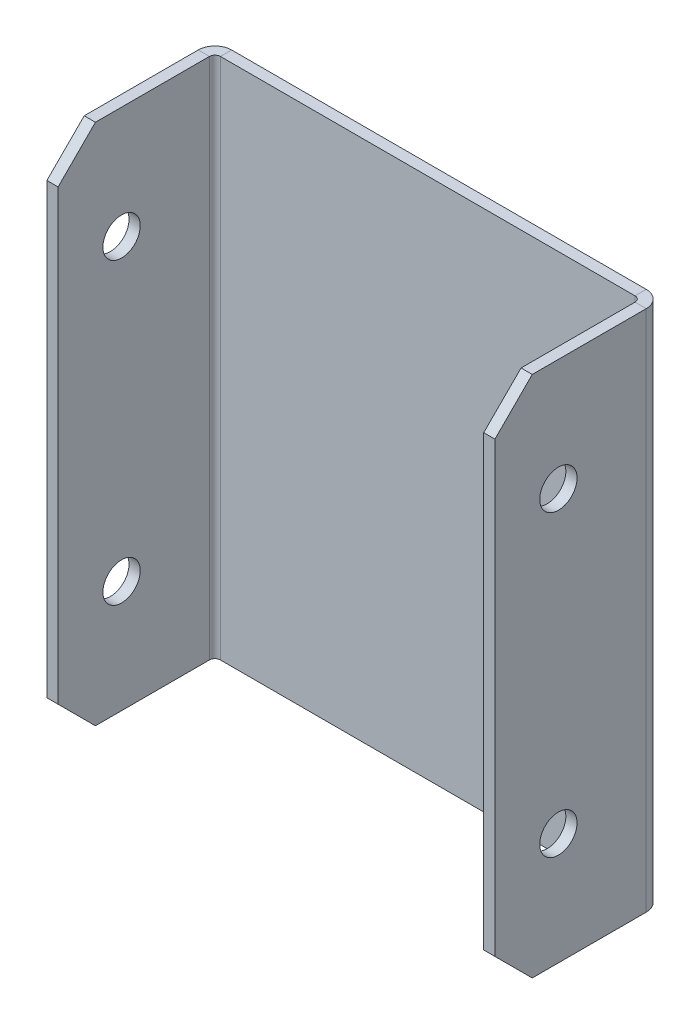
ISO-10303-21;
HEADER;
FILE_DESCRIPTION(('STEP AP214'),'2;1');
FILE_NAME('part.step','',(''),(''),'','','');
FILE_SCHEMA(('AUTOMOTIVE_DESIGN { 1 0 10303 214 1 1 1 1 }'));
ENDSEC;
DATA;
#1=APPLICATION_CONTEXT('core data for automotive mechanical design processes');
#2=APPLICATION_PROTOCOL_DEFINITION('international standard','automotive_design',2000,#1);
#3=PRODUCT_CONTEXT('',#1,'mechanical');
#4=PRODUCT('Part','Part','',(#3));
#5=PRODUCT_RELATED_PRODUCT_CATEGORY('part','',(#4));
#6=PRODUCT_DEFINITION_FORMATION('','',#4);
#7=PRODUCT_DEFINITION_CONTEXT('part definition',#1,'design');
#8=PRODUCT_DEFINITION('design','',#6,#7);
#9=PRODUCT_DEFINITION_SHAPE('','',#8);
#10=(LENGTH_UNIT() NAMED_UNIT(*) SI_UNIT(.MILLI.,.METRE.));
#11=(NAMED_UNIT(*) PLANE_ANGLE_UNIT() SI_UNIT($,.RADIAN.));
#12=(NAMED_UNIT(*) SI_UNIT($,.STERADIAN.) SOLID_ANGLE_UNIT());
#13=UNCERTAINTY_MEASURE_WITH_UNIT(LENGTH_MEASURE(1.E-05),#10,'distance_accuracy_value','');
#14=(GEOMETRIC_REPRESENTATION_CONTEXT(3) GLOBAL_UNCERTAINTY_ASSIGNED_CONTEXT((#13)) GLOBAL_UNIT_ASSIGNED_CONTEXT((#10,
#11,#12)) REPRESENTATION_CONTEXT('',''));
#15=CARTESIAN_POINT('',(0.,0.,0.));
#16=DIRECTION('',(0.,0.,1.));
#17=DIRECTION('',(1.,0.,0.));
#18=AXIS2_PLACEMENT_3D('',#15,#16,#17);
#19=CARTESIAN_POINT('',(0.,0.,-1.5));
#20=DIRECTION('',(0.,0.,1.));
#21=DIRECTION('',(1.,0.,0.));
#22=AXIS2_PLACEMENT_3D('',#19,#20,#21);
#23=PLANE('',#22);
#24=DIRECTION('',(0.,-1.,0.));
#25=VECTOR('',#24,1.);
#26=CARTESIAN_POINT('',(-27.7634,-35.,-1.5));
#27=LINE('',#26,#25);
#28=CARTESIAN_POINT('',(-27.7634,-35.,-1.5));
#29=VERTEX_POINT('',#28);
#30=CARTESIAN_POINT('',(-27.7634,35.,-1.5));
#31=VERTEX_POINT('',#30);
#32=EDGE_CURVE('E205',#29,#31,#27,.F.);
#33=ORIENTED_EDGE('',*,*,#32,.T.);
#34=DIRECTION('',(-1.,0.,0.));
#35=VECTOR('',#34,1.);
#36=CARTESIAN_POINT('',(-30.,35.,-1.5));
#37=LINE('',#36,#35);
#38=CARTESIAN_POINT('',(27.7634,35.,-1.5));
#39=VERTEX_POINT('',#38);
#40=EDGE_CURVE('E316',#39,#31,#37,.T.);
#41=ORIENTED_EDGE('',*,*,#40,.F.);
#42=DIRECTION('',(0.,1.,0.));
#43=VECTOR('',#42,1.);
#44=CARTESIAN_POINT('',(27.7634,35.,-1.5));
#45=LINE('',#44,#43);
#46=CARTESIAN_POINT('',(27.7634,-35.,-1.5));
#47=VERTEX_POINT('',#46);
#48=EDGE_CURVE('E292',#39,#47,#45,.F.);
#49=ORIENTED_EDGE('',*,*,#48,.T.);
#50=DIRECTION('',(1.,0.,0.));
#51=VECTOR('',#50,1.);
#52=CARTESIAN_POINT('',(-30.,-35.,-1.5));
#53=LINE('',#52,#51);
#54=EDGE_CURVE('E319',#29,#47,#53,.T.);
#55=ORIENTED_EDGE('',*,*,#54,.F.);
#56=EDGE_LOOP('',(#33,#41,#49,#55));
#57=FACE_BOUND('',#56,.T.);
#58=ADVANCED_FACE('F81',(#57),#23,.F.);
#59=CARTESIAN_POINT('',(0.,0.,0.));
#60=DIRECTION('',(0.,0.,1.));
#61=DIRECTION('',(1.,0.,0.));
#62=AXIS2_PLACEMENT_3D('',#59,#60,#61);
#63=PLANE('',#62);
#64=DIRECTION('',(-1.,0.,0.));
#65=VECTOR('',#64,1.);
#66=CARTESIAN_POINT('',(-30.,35.,0.));
#67=LINE('',#66,#65);
#68=CARTESIAN_POINT('',(27.7634,35.,0.));
#69=VERTEX_POINT('',#68);
#70=CARTESIAN_POINT('',(-27.7634,35.,0.));
#71=VERTEX_POINT('',#70);
#72=EDGE_CURVE('E313',#69,#71,#67,.T.);
#73=ORIENTED_EDGE('',*,*,#72,.T.);
#74=DIRECTION('',(0.,-1.,0.));
#75=VECTOR('',#74,1.);
#76=CARTESIAN_POINT('',(-27.7634,-35.,0.));
#77=LINE('',#76,#75);
#78=CARTESIAN_POINT('',(-27.7634,-35.,0.));
#79=VERTEX_POINT('',#78);
#80=EDGE_CURVE('E255',#79,#71,#77,.F.);
#81=ORIENTED_EDGE('',*,*,#80,.F.);
#82=DIRECTION('',(1.,0.,0.));
#83=VECTOR('',#82,1.);
#84=CARTESIAN_POINT('',(-30.,-35.,0.));
#85=LINE('',#84,#83);
#86=CARTESIAN_POINT('',(27.7634,-35.,0.));
#87=VERTEX_POINT('',#86);
#88=EDGE_CURVE('E320',#79,#87,#85,.T.);
#89=ORIENTED_EDGE('',*,*,#88,.T.);
#90=DIRECTION('',(0.,1.,0.));
#91=VECTOR('',#90,1.);
#92=CARTESIAN_POINT('',(27.7634,35.,0.));
#93=LINE('',#92,#91);
#94=EDGE_CURVE('E305',#69,#87,#93,.F.);
#95=ORIENTED_EDGE('',*,*,#94,.F.);
#96=EDGE_LOOP('',(#73,#81,#89,#95));
#97=FACE_BOUND('',#96,.T.);
#98=ADVANCED_FACE('F403',(#97),#63,.T.);
#99=CARTESIAN_POINT('',(-30.,-35.,-1.5));
#100=DIRECTION('',(0.,-1.,0.));
#101=DIRECTION('',(0.,0.,-1.));
#102=AXIS2_PLACEMENT_3D('',#99,#100,#101);
#103=PLANE('',#102);
#104=ORIENTED_EDGE('',*,*,#88,.F.);
#105=DIRECTION('',(0.,0.,-1.));
#106=VECTOR('',#105,1.);
#107=CARTESIAN_POINT('',(-27.7634,-35.,0.));
#108=LINE('',#107,#106);
#109=EDGE_CURVE('E251',#79,#29,#108,.T.);
#110=ORIENTED_EDGE('',*,*,#109,.T.);
#111=ORIENTED_EDGE('',*,*,#54,.T.);
#112=DIRECTION('',(0.,0.,-1.));
#113=VECTOR('',#112,1.);
#114=CARTESIAN_POINT('',(27.7634,-35.,0.));
#115=LINE('',#114,#113);
#116=EDGE_CURVE('E310',#87,#47,#115,.T.);
#117=ORIENTED_EDGE('',*,*,#116,.F.);
#118=EDGE_LOOP('',(#104,#110,#111,#117));
#119=FACE_BOUND('',#118,.T.);
#120=ADVANCED_FACE('F407',(#119),#103,.T.);
#121=CARTESIAN_POINT('',(-30.,35.,-1.5));
#122=DIRECTION('',(0.,1.,0.));
#123=DIRECTION('',(0.,0.,1.));
#124=AXIS2_PLACEMENT_3D('',#121,#122,#123);
#125=PLANE('',#124);
#126=DIRECTION('',(0.,0.,-1.));
#127=VECTOR('',#126,1.);
#128=CARTESIAN_POINT('',(-27.7634,35.,0.));
#129=LINE('',#128,#127);
#130=EDGE_CURVE('E259',#71,#31,#129,.T.);
#131=ORIENTED_EDGE('',*,*,#130,.F.);
#132=ORIENTED_EDGE('',*,*,#72,.F.);
#133=DIRECTION('',(0.,0.,-1.));
#134=VECTOR('',#133,1.);
#135=CARTESIAN_POINT('',(27.7634,35.,0.));
#136=LINE('',#135,#134);
#137=EDGE_CURVE('E299',#69,#39,#136,.T.);
#138=ORIENTED_EDGE('',*,*,#137,.T.);
#139=ORIENTED_EDGE('',*,*,#40,.T.);
#140=EDGE_LOOP('',(#131,#132,#138,#139));
#141=FACE_BOUND('',#140,.T.);
#142=ADVANCED_FACE('F470',(#141),#125,.T.);
#143=CARTESIAN_POINT('',(27.7634,-35.,0.736599999999999));
#144=DIRECTION('',(0.,-1.,0.));
#145=DIRECTION('',(0.,0.,-1.));
#146=AXIS2_PLACEMENT_3D('',#143,#144,#145);
#147=PLANE('',#146);
#148=DIRECTION('',(-1.,0.,0.));
#149=VECTOR('',#148,1.);
#150=CARTESIAN_POINT('',(30.,-35.,0.736599999999992));
#151=LINE('',#150,#149);
#152=CARTESIAN_POINT('',(28.5,-35.,0.736599999999996));
#153=VERTEX_POINT('',#152);
#154=CARTESIAN_POINT('',(30.,-35.,0.736599999999991));
#155=VERTEX_POINT('',#154);
#156=EDGE_CURVE('E262',#153,#155,#151,.F.);
#157=ORIENTED_EDGE('',*,*,#156,.F.);
#158=CARTESIAN_POINT('',(27.7634,-35.,0.736599999999999));
#159=DIRECTION('',(0.,1.,0.));
#160=DIRECTION('',(0.,0.,1.));
#161=AXIS2_PLACEMENT_3D('',#158,#159,#160);
#162=CIRCLE('',#161,0.736600000000004);
#163=EDGE_CURVE('E302',#87,#153,#162,.F.);
#164=ORIENTED_EDGE('',*,*,#163,.F.);
#165=ORIENTED_EDGE('',*,*,#116,.T.);
#166=CARTESIAN_POINT('',(27.7634,-35.,0.736599999999999));
#167=DIRECTION('',(0.,1.,0.));
#168=DIRECTION('',(0.,0.,1.));
#169=AXIS2_PLACEMENT_3D('',#166,#167,#168);
#170=CIRCLE('',#169,2.2366);
#171=EDGE_CURVE('E295',#47,#155,#170,.F.);
#172=ORIENTED_EDGE('',*,*,#171,.T.);
#173=EDGE_LOOP('',(#157,#164,#165,#172));
#174=FACE_BOUND('',#173,.T.);
#175=ADVANCED_FACE('F416',(#174),#147,.T.);
#176=CARTESIAN_POINT('',(27.7634,35.,0.736600000000004));
#177=DIRECTION('',(0.,-1.,0.));
#178=DIRECTION('',(0.,0.,-1.));
#179=AXIS2_PLACEMENT_3D('',#176,#177,#178);
#180=PLANE('',#179);
#181=CARTESIAN_POINT('',(27.7634,35.,0.736600000000004));
#182=DIRECTION('',(0.,1.,0.));
#183=DIRECTION('',(0.,0.,1.));
#184=AXIS2_PLACEMENT_3D('',#181,#182,#183);
#185=CIRCLE('',#184,0.736600000000004);
#186=CARTESIAN_POINT('',(28.5,35.,0.736600000000001));
#187=VERTEX_POINT('',#186);
#188=EDGE_CURVE('E267',#187,#69,#185,.T.);
#189=ORIENTED_EDGE('',*,*,#188,.F.);
#190=DIRECTION('',(-1.,0.,0.));
#191=VECTOR('',#190,1.);
#192=CARTESIAN_POINT('',(28.5,35.,0.7366));
#193=LINE('',#192,#191);
#194=CARTESIAN_POINT('',(30.,35.,0.736599999999995));
#195=VERTEX_POINT('',#194);
#196=EDGE_CURVE('E285',#187,#195,#193,.F.);
#197=ORIENTED_EDGE('',*,*,#196,.T.);
#198=CARTESIAN_POINT('',(27.7634,35.,0.736600000000004));
#199=DIRECTION('',(0.,1.,0.));
#200=DIRECTION('',(0.,0.,1.));
#201=AXIS2_PLACEMENT_3D('',#198,#199,#200);
#202=CIRCLE('',#201,2.2366);
#203=EDGE_CURVE('E296',#195,#39,#202,.T.);
#204=ORIENTED_EDGE('',*,*,#203,.T.);
#205=ORIENTED_EDGE('',*,*,#137,.F.);
#206=EDGE_LOOP('',(#189,#197,#204,#205));
#207=FACE_BOUND('',#206,.T.);
#208=ADVANCED_FACE('F429',(#207),#180,.F.);
#209=CARTESIAN_POINT('',(27.7634,35.,0.736600000000004));
#210=DIRECTION('',(0.,1.,0.));
#211=DIRECTION('',(1.,0.,0.));
#212=AXIS2_PLACEMENT_3D('',#209,#210,#211);
#213=CYLINDRICAL_SURFACE('',#212,2.2366);
#214=ORIENTED_EDGE('',*,*,#48,.F.);
#215=ORIENTED_EDGE('',*,*,#203,.F.);
#216=DIRECTION('',(0.,1.,0.));
#217=VECTOR('',#216,1.);
#218=CARTESIAN_POINT('',(30.,-35.,0.736599999999992));
#219=LINE('',#218,#217);
#220=EDGE_CURVE('E282',#195,#155,#219,.F.);
#221=ORIENTED_EDGE('',*,*,#220,.T.);
#222=ORIENTED_EDGE('',*,*,#171,.F.);
#223=EDGE_LOOP('',(#214,#215,#221,#222));
#224=FACE_BOUND('',#223,.T.);
#225=ADVANCED_FACE('F488',(#224),#213,.T.);
#226=CARTESIAN_POINT('',(27.7634,35.,0.736600000000004));
#227=DIRECTION('',(0.,1.,0.));
#228=DIRECTION('',(1.,0.,0.));
#229=AXIS2_PLACEMENT_3D('',#226,#227,#228);
#230=CYLINDRICAL_SURFACE('',#229,0.736600000000004);
#231=ORIENTED_EDGE('',*,*,#94,.T.);
#232=ORIENTED_EDGE('',*,*,#163,.T.);
#233=DIRECTION('',(0.,1.,0.));
#234=VECTOR('',#233,1.);
#235=CARTESIAN_POINT('',(28.5,-35.,0.736599999999997));
#236=LINE('',#235,#234);
#237=EDGE_CURVE('E288',#153,#187,#236,.T.);
#238=ORIENTED_EDGE('',*,*,#237,.T.);
#239=ORIENTED_EDGE('',*,*,#188,.T.);
#240=EDGE_LOOP('',(#231,#232,#238,#239));
#241=FACE_BOUND('',#240,.T.);
#242=ADVANCED_FACE('F412',(#241),#230,.F.);
#243=CARTESIAN_POINT('',(30.0000000000001,35.,21.));
#244=DIRECTION('',(0.,-1.,0.));
#245=DIRECTION('',(1.,0.,0.));
#246=AXIS2_PLACEMENT_3D('',#243,#244,#245);
#247=PLANE('',#246);
#248=DIRECTION('',(0.,0.,-1.));
#249=VECTOR('',#248,1.);
#250=CARTESIAN_POINT('',(28.5000000000001,35.,21.));
#251=LINE('',#250,#249);
#252=CARTESIAN_POINT('',(28.5,35.,16.));
#253=VERTEX_POINT('',#252);
#254=EDGE_CURVE('E279',#187,#253,#251,.F.);
#255=ORIENTED_EDGE('',*,*,#254,.T.);
#256=DIRECTION('',(1.,0.,0.));
#257=VECTOR('',#256,1.);
#258=CARTESIAN_POINT('',(30.,35.,16.));
#259=LINE('',#258,#257);
#260=CARTESIAN_POINT('',(30.,35.,16.));
#261=VERTEX_POINT('',#260);
#262=EDGE_CURVE('E330',#253,#261,#259,.T.);
#263=ORIENTED_EDGE('',*,*,#262,.T.);
#264=DIRECTION('',(0.,0.,1.));
#265=VECTOR('',#264,1.);
#266=CARTESIAN_POINT('',(30.,35.,-1.09320630566873E-13));
#267=LINE('',#266,#265);
#268=EDGE_CURVE('E271',#195,#261,#267,.T.);
#269=ORIENTED_EDGE('',*,*,#268,.F.);
#270=ORIENTED_EDGE('',*,*,#196,.F.);
#271=EDGE_LOOP('',(#255,#263,#269,#270));
#272=FACE_BOUND('',#271,.T.);
#273=ADVANCED_FACE('F433',(#272),#247,.F.);
#274=CARTESIAN_POINT('',(30.,-35.,0.));
#275=DIRECTION('',(0.,1.,0.));
#276=DIRECTION('',(-1.,0.,0.));
#277=AXIS2_PLACEMENT_3D('',#274,#275,#276);
#278=PLANE('',#277);
#279=DIRECTION('',(0.,0.,-1.));
#280=VECTOR('',#279,1.);
#281=CARTESIAN_POINT('',(30.,-35.,-1.09320630566873E-13));
#282=LINE('',#281,#280);
#283=CARTESIAN_POINT('',(30.,-35.,16.));
#284=VERTEX_POINT('',#283);
#285=EDGE_CURVE('E265',#284,#155,#282,.T.);
#286=ORIENTED_EDGE('',*,*,#285,.F.);
#287=DIRECTION('',(-1.,0.,0.));
#288=VECTOR('',#287,1.);
#289=CARTESIAN_POINT('',(30.0000000000001,-35.,16.));
#290=LINE('',#289,#288);
#291=CARTESIAN_POINT('',(28.5000000000001,-35.,16.));
#292=VERTEX_POINT('',#291);
#293=EDGE_CURVE('E334',#284,#292,#290,.T.);
#294=ORIENTED_EDGE('',*,*,#293,.T.);
#295=DIRECTION('',(0.,0.,1.));
#296=VECTOR('',#295,1.);
#297=CARTESIAN_POINT('',(28.5,-35.,0.));
#298=LINE('',#297,#296);
#299=EDGE_CURVE('E274',#292,#153,#298,.F.);
#300=ORIENTED_EDGE('',*,*,#299,.T.);
#301=ORIENTED_EDGE('',*,*,#156,.T.);
#302=EDGE_LOOP('',(#286,#294,#300,#301));
#303=FACE_BOUND('',#302,.T.);
#304=ADVANCED_FACE('F419',(#303),#278,.F.);
#305=CARTESIAN_POINT('',(30.,0.,-1.09320630566873E-13));
#306=DIRECTION('',(-1.,0.,0.));
#307=DIRECTION('',(0.,0.,1.));
#308=AXIS2_PLACEMENT_3D('',#305,#306,#307);
#309=PLANE('',#308);
#310=CARTESIAN_POINT('',(30.,20.,12.5));
#311=DIRECTION('',(1.,0.,0.));
#312=DIRECTION('',(0.,0.,-1.));
#313=AXIS2_PLACEMENT_3D('',#310,#311,#312);
#314=CIRCLE('',#313,2.5);
#315=CARTESIAN_POINT('',(30.,20.,9.99999999999999));
#316=VERTEX_POINT('',#315);
#317=EDGE_CURVE('E364',#316,#316,#314,.T.);
#318=ORIENTED_EDGE('',*,*,#317,.F.);
#319=EDGE_LOOP('',(#318));
#320=FACE_BOUND('',#319,.T.);
#321=CARTESIAN_POINT('',(30.,-20.,12.5));
#322=DIRECTION('',(1.,0.,0.));
#323=DIRECTION('',(0.,0.,-1.));
#324=AXIS2_PLACEMENT_3D('',#321,#322,#323);
#325=CIRCLE('',#324,2.5);
#326=CARTESIAN_POINT('',(30.,-20.,9.99999999999999));
#327=VERTEX_POINT('',#326);
#328=EDGE_CURVE('E374',#327,#327,#325,.T.);
#329=ORIENTED_EDGE('',*,*,#328,.F.);
#330=EDGE_LOOP('',(#329));
#331=FACE_BOUND('',#330,.T.);
#332=DIRECTION('',(0.,-1.,0.));
#333=VECTOR('',#332,1.);
#334=CARTESIAN_POINT('',(30.0000000000001,0.,21.));
#335=LINE('',#334,#333);
#336=CARTESIAN_POINT('',(30.0000000000001,30.,21.));
#337=VERTEX_POINT('',#336);
#338=CARTESIAN_POINT('',(30.0000000000001,-30.,21.));
#339=VERTEX_POINT('',#338);
#340=EDGE_CURVE('E268',#337,#339,#335,.T.);
#341=ORIENTED_EDGE('',*,*,#340,.T.);
#342=DIRECTION('',(0.,0.707106781186548,0.707106781186548));
#343=VECTOR('',#342,1.);
#344=CARTESIAN_POINT('',(30.0000000000001,-35.,16.));
#345=LINE('',#344,#343);
#346=EDGE_CURVE('E341',#339,#284,#345,.F.);
#347=ORIENTED_EDGE('',*,*,#346,.T.);
#348=ORIENTED_EDGE('',*,*,#285,.T.);
#349=ORIENTED_EDGE('',*,*,#220,.F.);
#350=ORIENTED_EDGE('',*,*,#268,.T.);
#351=DIRECTION('',(0.,0.707106781186547,-0.707106781186548));
#352=VECTOR('',#351,1.);
#353=CARTESIAN_POINT('',(30.0000000000001,30.,21.));
#354=LINE('',#353,#352);
#355=EDGE_CURVE('E332',#261,#337,#354,.F.);
#356=ORIENTED_EDGE('',*,*,#355,.T.);
#357=EDGE_LOOP('',(#341,#347,#348,#349,#350,#356));
#358=FACE_BOUND('',#357,.T.);
#359=ADVANCED_FACE('F437',(#320,#331,#358),#309,.F.);
#360=CARTESIAN_POINT('',(28.5,0.,-1.04083408558608E-13));
#361=DIRECTION('',(-1.,0.,0.));
#362=DIRECTION('',(0.,0.,1.));
#363=AXIS2_PLACEMENT_3D('',#360,#361,#362);
#364=PLANE('',#363);
#365=CARTESIAN_POINT('',(28.5,20.,12.5));
#366=DIRECTION('',(-1.,0.,0.));
#367=DIRECTION('',(0.,0.,1.));
#368=AXIS2_PLACEMENT_3D('',#365,#366,#367);
#369=CIRCLE('',#368,2.5);
#370=CARTESIAN_POINT('',(28.5,20.,15.));
#371=VERTEX_POINT('',#370);
#372=EDGE_CURVE('E248',#371,#371,#369,.T.);
#373=ORIENTED_EDGE('',*,*,#372,.F.);
#374=EDGE_LOOP('',(#373));
#375=FACE_BOUND('',#374,.T.);
#376=CARTESIAN_POINT('',(28.5,-20.,12.5));
#377=DIRECTION('',(-1.,0.,0.));
#378=DIRECTION('',(0.,0.,1.));
#379=AXIS2_PLACEMENT_3D('',#376,#377,#378);
#380=CIRCLE('',#379,2.5);
#381=CARTESIAN_POINT('',(28.5,-20.,15.));
#382=VERTEX_POINT('',#381);
#383=EDGE_CURVE('E357',#382,#382,#380,.T.);
#384=ORIENTED_EDGE('',*,*,#383,.F.);
#385=EDGE_LOOP('',(#384));
#386=FACE_BOUND('',#385,.T.);
#387=ORIENTED_EDGE('',*,*,#299,.F.);
#388=DIRECTION('',(0.,-0.707106781186548,-0.707106781186548));
#389=VECTOR('',#388,1.);
#390=CARTESIAN_POINT('',(28.5000000000001,-25.5,25.4999999999999));
#391=LINE('',#390,#389);
#392=CARTESIAN_POINT('',(28.5000000000001,-30.,21.));
#393=VERTEX_POINT('',#392);
#394=EDGE_CURVE('E337',#292,#393,#391,.F.);
#395=ORIENTED_EDGE('',*,*,#394,.T.);
#396=DIRECTION('',(0.,1.,0.));
#397=VECTOR('',#396,1.);
#398=CARTESIAN_POINT('',(28.5000000000001,-35.,21.));
#399=LINE('',#398,#397);
#400=CARTESIAN_POINT('',(28.5000000000001,30.,21.));
#401=VERTEX_POINT('',#400);
#402=EDGE_CURVE('E276',#401,#393,#399,.F.);
#403=ORIENTED_EDGE('',*,*,#402,.F.);
#404=DIRECTION('',(0.,-0.707106781186547,0.707106781186548));
#405=VECTOR('',#404,1.);
#406=CARTESIAN_POINT('',(28.5000000000001,25.5,25.4999999999999));
#407=LINE('',#406,#405);
#408=EDGE_CURVE('E328',#401,#253,#407,.F.);
#409=ORIENTED_EDGE('',*,*,#408,.T.);
#410=ORIENTED_EDGE('',*,*,#254,.F.);
#411=ORIENTED_EDGE('',*,*,#237,.F.);
#412=EDGE_LOOP('',(#387,#395,#403,#409,#410,#411));
#413=FACE_BOUND('',#412,.T.);
#414=ADVANCED_FACE('F423',(#375,#386,#413),#364,.T.);
#415=CARTESIAN_POINT('',(30.0000000000001,-35.,21.));
#416=DIRECTION('',(0.,0.,-1.));
#417=DIRECTION('',(-1.,0.,0.));
#418=AXIS2_PLACEMENT_3D('',#415,#416,#417);
#419=PLANE('',#418);
#420=ORIENTED_EDGE('',*,*,#402,.T.);
#421=DIRECTION('',(1.,0.,0.));
#422=VECTOR('',#421,1.);
#423=CARTESIAN_POINT('',(30.0000000000001,-30.,21.));
#424=LINE('',#423,#422);
#425=EDGE_CURVE('E339',#393,#339,#424,.T.);
#426=ORIENTED_EDGE('',*,*,#425,.T.);
#427=ORIENTED_EDGE('',*,*,#340,.F.);
#428=DIRECTION('',(-1.,0.,0.));
#429=VECTOR('',#428,1.);
#430=CARTESIAN_POINT('',(30.0000000000001,30.,21.));
#431=LINE('',#430,#429);
#432=EDGE_CURVE('E322',#337,#401,#431,.T.);
#433=ORIENTED_EDGE('',*,*,#432,.T.);
#434=EDGE_LOOP('',(#420,#426,#427,#433));
#435=FACE_BOUND('',#434,.T.);
#436=ADVANCED_FACE('F443',(#435),#419,.F.);
#437=CARTESIAN_POINT('',(-27.7634,35.,0.736599999999999));
#438=DIRECTION('',(0.,1.,0.));
#439=DIRECTION('',(0.,0.,1.));
#440=AXIS2_PLACEMENT_3D('',#437,#438,#439);
#441=PLANE('',#440);
#442=DIRECTION('',(1.,0.,0.));
#443=VECTOR('',#442,1.);
#444=CARTESIAN_POINT('',(-30.,35.,0.736599999999992));
#445=LINE('',#444,#443);
#446=CARTESIAN_POINT('',(-28.5,35.,0.736599999999996));
#447=VERTEX_POINT('',#446);
#448=CARTESIAN_POINT('',(-30.,35.,0.736599999999991));
#449=VERTEX_POINT('',#448);
#450=EDGE_CURVE('E245',#447,#449,#445,.F.);
#451=ORIENTED_EDGE('',*,*,#450,.F.);
#452=CARTESIAN_POINT('',(-27.7634,35.,0.736599999999999));
#453=DIRECTION('',(0.,-1.,0.));
#454=DIRECTION('',(0.,0.,-1.));
#455=AXIS2_PLACEMENT_3D('',#452,#453,#454);
#456=CIRCLE('',#455,0.736600000000004);
#457=EDGE_CURVE('E208',#71,#447,#456,.F.);
#458=ORIENTED_EDGE('',*,*,#457,.F.);
#459=ORIENTED_EDGE('',*,*,#130,.T.);
#460=CARTESIAN_POINT('',(-27.7634,35.,0.736599999999999));
#461=DIRECTION('',(0.,-1.,0.));
#462=DIRECTION('',(0.,0.,-1.));
#463=AXIS2_PLACEMENT_3D('',#460,#461,#462);
#464=CIRCLE('',#463,2.2366);
#465=EDGE_CURVE('E250',#31,#449,#464,.F.);
#466=ORIENTED_EDGE('',*,*,#465,.T.);
#467=EDGE_LOOP('',(#451,#458,#459,#466));
#468=FACE_BOUND('',#467,.T.);
#469=ADVANCED_FACE('F398',(#468),#441,.T.);
#470=CARTESIAN_POINT('',(-27.7634,-35.,0.736600000000004));
#471=DIRECTION('',(0.,1.,0.));
#472=DIRECTION('',(0.,0.,1.));
#473=AXIS2_PLACEMENT_3D('',#470,#471,#472);
#474=PLANE('',#473);
#475=CARTESIAN_POINT('',(-27.7634,-35.,0.736600000000004));
#476=DIRECTION('',(0.,-1.,0.));
#477=DIRECTION('',(0.,0.,-1.));
#478=AXIS2_PLACEMENT_3D('',#475,#476,#477);
#479=CIRCLE('',#478,0.736600000000004);
#480=CARTESIAN_POINT('',(-28.5,-35.,0.736600000000001));
#481=VERTEX_POINT('',#480);
#482=EDGE_CURVE('E215',#481,#79,#479,.T.);
#483=ORIENTED_EDGE('',*,*,#482,.F.);
#484=DIRECTION('',(1.,0.,0.));
#485=VECTOR('',#484,1.);
#486=CARTESIAN_POINT('',(-28.5,-35.,0.7366));
#487=LINE('',#486,#485);
#488=CARTESIAN_POINT('',(-30.,-35.,0.736599999999995));
#489=VERTEX_POINT('',#488);
#490=EDGE_CURVE('E212',#481,#489,#487,.F.);
#491=ORIENTED_EDGE('',*,*,#490,.T.);
#492=CARTESIAN_POINT('',(-27.7634,-35.,0.736600000000004));
#493=DIRECTION('',(0.,-1.,0.));
#494=DIRECTION('',(0.,0.,-1.));
#495=AXIS2_PLACEMENT_3D('',#492,#493,#494);
#496=CIRCLE('',#495,2.2366);
#497=EDGE_CURVE('E198',#489,#29,#496,.T.);
#498=ORIENTED_EDGE('',*,*,#497,.T.);
#499=ORIENTED_EDGE('',*,*,#109,.F.);
#500=EDGE_LOOP('',(#483,#491,#498,#499));
#501=FACE_BOUND('',#500,.T.);
#502=ADVANCED_FACE('F213',(#501),#474,.F.);
#503=CARTESIAN_POINT('',(-27.7634,-35.,0.736600000000004));
#504=DIRECTION('',(0.,-1.,0.));
#505=DIRECTION('',(-1.,0.,0.));
#506=AXIS2_PLACEMENT_3D('',#503,#504,#505);
#507=CYLINDRICAL_SURFACE('',#506,2.2366);
#508=ORIENTED_EDGE('',*,*,#32,.F.);
#509=ORIENTED_EDGE('',*,*,#497,.F.);
#510=DIRECTION('',(0.,-1.,0.));
#511=VECTOR('',#510,1.);
#512=CARTESIAN_POINT('',(-30.,35.,0.736599999999992));
#513=LINE('',#512,#511);
#514=EDGE_CURVE('E203',#489,#449,#513,.F.);
#515=ORIENTED_EDGE('',*,*,#514,.T.);
#516=ORIENTED_EDGE('',*,*,#465,.F.);
#517=EDGE_LOOP('',(#508,#509,#515,#516));
#518=FACE_BOUND('',#517,.T.);
#519=ADVANCED_FACE('F200',(#518),#507,.T.);
#520=CARTESIAN_POINT('',(-27.7634,-35.,0.736600000000004));
#521=DIRECTION('',(0.,-1.,0.));
#522=DIRECTION('',(-1.,0.,0.));
#523=AXIS2_PLACEMENT_3D('',#520,#521,#522);
#524=CYLINDRICAL_SURFACE('',#523,0.736600000000004);
#525=ORIENTED_EDGE('',*,*,#80,.T.);
#526=ORIENTED_EDGE('',*,*,#457,.T.);
#527=DIRECTION('',(0.,-1.,0.));
#528=VECTOR('',#527,1.);
#529=CARTESIAN_POINT('',(-28.5,35.,0.736599999999997));
#530=LINE('',#529,#528);
#531=EDGE_CURVE('E220',#447,#481,#530,.T.);
#532=ORIENTED_EDGE('',*,*,#531,.T.);
#533=ORIENTED_EDGE('',*,*,#482,.T.);
#534=EDGE_LOOP('',(#525,#526,#532,#533));
#535=FACE_BOUND('',#534,.T.);
#536=ADVANCED_FACE('F400',(#535),#524,.F.);
#537=CARTESIAN_POINT('',(-30.0000000000001,-35.,21.));
#538=DIRECTION('',(0.,1.,0.));
#539=DIRECTION('',(-1.,0.,0.));
#540=AXIS2_PLACEMENT_3D('',#537,#538,#539);
#541=PLANE('',#540);
#542=DIRECTION('',(0.,0.,-1.));
#543=VECTOR('',#542,1.);
#544=CARTESIAN_POINT('',(-28.5000000000001,-35.,21.));
#545=LINE('',#544,#543);
#546=CARTESIAN_POINT('',(-28.5000000000001,-35.,16.));
#547=VERTEX_POINT('',#546);
#548=EDGE_CURVE('E229',#481,#547,#545,.F.);
#549=ORIENTED_EDGE('',*,*,#548,.T.);
#550=DIRECTION('',(-1.,0.,0.));
#551=VECTOR('',#550,1.);
#552=CARTESIAN_POINT('',(-30.,-35.,16.));
#553=LINE('',#552,#551);
#554=CARTESIAN_POINT('',(-30.,-35.,16.));
#555=VERTEX_POINT('',#554);
#556=EDGE_CURVE('E233',#547,#555,#553,.T.);
#557=ORIENTED_EDGE('',*,*,#556,.T.);
#558=DIRECTION('',(0.,0.,1.));
#559=VECTOR('',#558,1.);
#560=CARTESIAN_POINT('',(-30.,-35.,-1.09320630566873E-13));
#561=LINE('',#560,#559);
#562=EDGE_CURVE('E225',#489,#555,#561,.T.);
#563=ORIENTED_EDGE('',*,*,#562,.F.);
#564=ORIENTED_EDGE('',*,*,#490,.F.);
#565=EDGE_LOOP('',(#549,#557,#563,#564));
#566=FACE_BOUND('',#565,.T.);
#567=ADVANCED_FACE('F231',(#566),#541,.F.);
#568=CARTESIAN_POINT('',(-30.,35.,0.));
#569=DIRECTION('',(0.,-1.,0.));
#570=DIRECTION('',(1.,0.,0.));
#571=AXIS2_PLACEMENT_3D('',#568,#569,#570);
#572=PLANE('',#571);
#573=DIRECTION('',(0.,0.,-1.));
#574=VECTOR('',#573,1.);
#575=CARTESIAN_POINT('',(-30.,35.,-1.09320630566873E-13));
#576=LINE('',#575,#574);
#577=CARTESIAN_POINT('',(-30.0000000000001,35.,16.));
#578=VERTEX_POINT('',#577);
#579=EDGE_CURVE('E228',#578,#449,#576,.T.);
#580=ORIENTED_EDGE('',*,*,#579,.F.);
#581=DIRECTION('',(1.,0.,0.));
#582=VECTOR('',#581,1.);
#583=CARTESIAN_POINT('',(-30.0000000000001,35.,16.));
#584=LINE('',#583,#582);
#585=CARTESIAN_POINT('',(-28.5000000000001,35.,16.));
#586=VERTEX_POINT('',#585);
#587=EDGE_CURVE('E351',#578,#586,#584,.T.);
#588=ORIENTED_EDGE('',*,*,#587,.T.);
#589=DIRECTION('',(0.,0.,1.));
#590=VECTOR('',#589,1.);
#591=CARTESIAN_POINT('',(-28.5,35.,0.));
#592=LINE('',#591,#590);
#593=EDGE_CURVE('E235',#586,#447,#592,.F.);
#594=ORIENTED_EDGE('',*,*,#593,.T.);
#595=ORIENTED_EDGE('',*,*,#450,.T.);
#596=EDGE_LOOP('',(#580,#588,#594,#595));
#597=FACE_BOUND('',#596,.T.);
#598=ADVANCED_FACE('F394',(#597),#572,.F.);
#599=CARTESIAN_POINT('',(-30.,0.,-1.09320630566873E-13));
#600=DIRECTION('',(1.,0.,0.));
#601=DIRECTION('',(0.,0.,-1.));
#602=AXIS2_PLACEMENT_3D('',#599,#600,#601);
#603=PLANE('',#602);
#604=CARTESIAN_POINT('',(-30.0000000000001,20.,12.5000000000002));
#605=DIRECTION('',(1.,0.,0.));
#606=DIRECTION('',(0.,0.,-1.));
#607=AXIS2_PLACEMENT_3D('',#604,#605,#606);
#608=CIRCLE('',#607,2.5);
#609=CARTESIAN_POINT('',(-30.0000000000001,20.,10.0000000000002));
#610=VERTEX_POINT('',#609);
#611=EDGE_CURVE('E358',#610,#610,#608,.T.);
#612=ORIENTED_EDGE('',*,*,#611,.T.);
#613=EDGE_LOOP('',(#612));
#614=FACE_BOUND('',#613,.T.);
#615=CARTESIAN_POINT('',(-30.0000000000001,-20.,12.5000000000002));
#616=DIRECTION('',(1.,0.,0.));
#617=DIRECTION('',(0.,0.,-1.));
#618=AXIS2_PLACEMENT_3D('',#615,#616,#617);
#619=CIRCLE('',#618,2.5);
#620=CARTESIAN_POINT('',(-30.0000000000001,-20.,10.0000000000002));
#621=VERTEX_POINT('',#620);
#622=EDGE_CURVE('E369',#621,#621,#619,.T.);
#623=ORIENTED_EDGE('',*,*,#622,.T.);
#624=EDGE_LOOP('',(#623));
#625=FACE_BOUND('',#624,.T.);
#626=DIRECTION('',(0.,1.,0.));
#627=VECTOR('',#626,1.);
#628=CARTESIAN_POINT('',(-30.0000000000001,0.,21.));
#629=LINE('',#628,#627);
#630=CARTESIAN_POINT('',(-30.0000000000001,-30.,21.));
#631=VERTEX_POINT('',#630);
#632=CARTESIAN_POINT('',(-30.0000000000001,30.,21.));
#633=VERTEX_POINT('',#632);
#634=EDGE_CURVE('E234',#631,#633,#629,.T.);
#635=ORIENTED_EDGE('',*,*,#634,.T.);
#636=DIRECTION('',(0.,-0.707106781186548,0.707106781186548));
#637=VECTOR('',#636,1.);
#638=CARTESIAN_POINT('',(-30.0000000000001,35.,16.));
#639=LINE('',#638,#637);
#640=EDGE_CURVE('E13',#633,#578,#639,.F.);
#641=ORIENTED_EDGE('',*,*,#640,.T.);
#642=ORIENTED_EDGE('',*,*,#579,.T.);
#643=ORIENTED_EDGE('',*,*,#514,.F.);
#644=ORIENTED_EDGE('',*,*,#562,.T.);
#645=DIRECTION('',(0.,-0.707106781186547,-0.707106781186548));
#646=VECTOR('',#645,1.);
#647=CARTESIAN_POINT('',(-30.0000000000001,-30.,21.));
#648=LINE('',#647,#646);
#649=EDGE_CURVE('E349',#555,#631,#648,.F.);
#650=ORIENTED_EDGE('',*,*,#649,.T.);
#651=EDGE_LOOP('',(#635,#641,#642,#643,#644,#650));
#652=FACE_BOUND('',#651,.T.);
#653=ADVANCED_FACE('F224',(#614,#625,#652),#603,.F.);
#654=CARTESIAN_POINT('',(-28.5,0.,-1.04083408558608E-13));
#655=DIRECTION('',(1.,0.,0.));
#656=DIRECTION('',(0.,0.,-1.));
#657=AXIS2_PLACEMENT_3D('',#654,#655,#656);
#658=PLANE('',#657);
#659=CARTESIAN_POINT('',(-28.5,20.,12.5000000000002));
#660=DIRECTION('',(1.,0.,0.));
#661=DIRECTION('',(0.,0.,-1.));
#662=AXIS2_PLACEMENT_3D('',#659,#660,#661);
#663=CIRCLE('',#662,2.5);
#664=CARTESIAN_POINT('',(-28.5,20.,10.0000000000002));
#665=VERTEX_POINT('',#664);
#666=EDGE_CURVE('E86',#665,#665,#663,.T.);
#667=ORIENTED_EDGE('',*,*,#666,.F.);
#668=EDGE_LOOP('',(#667));
#669=FACE_BOUND('',#668,.T.);
#670=CARTESIAN_POINT('',(-28.5,-20.,12.5000000000002));
#671=DIRECTION('',(1.,0.,0.));
#672=DIRECTION('',(0.,0.,-1.));
#673=AXIS2_PLACEMENT_3D('',#670,#671,#672);
#674=CIRCLE('',#673,2.5);
#675=CARTESIAN_POINT('',(-28.5,-20.,10.0000000000002));
#676=VERTEX_POINT('',#675);
#677=EDGE_CURVE('E355',#676,#676,#674,.T.);
#678=ORIENTED_EDGE('',*,*,#677,.F.);
#679=EDGE_LOOP('',(#678));
#680=FACE_BOUND('',#679,.T.);
#681=ORIENTED_EDGE('',*,*,#593,.F.);
#682=DIRECTION('',(0.,0.707106781186548,-0.707106781186548));
#683=VECTOR('',#682,1.);
#684=CARTESIAN_POINT('',(-28.5000000000001,25.5,25.4999999999999));
#685=LINE('',#684,#683);
#686=CARTESIAN_POINT('',(-28.5000000000001,30.,21.));
#687=VERTEX_POINT('',#686);
#688=EDGE_CURVE('E106',#586,#687,#685,.F.);
#689=ORIENTED_EDGE('',*,*,#688,.T.);
#690=DIRECTION('',(0.,-1.,0.));
#691=VECTOR('',#690,1.);
#692=CARTESIAN_POINT('',(-28.5000000000001,35.,21.));
#693=LINE('',#692,#691);
#694=CARTESIAN_POINT('',(-28.5000000000001,-30.,21.));
#695=VERTEX_POINT('',#694);
#696=EDGE_CURVE('E238',#695,#687,#693,.F.);
#697=ORIENTED_EDGE('',*,*,#696,.F.);
#698=DIRECTION('',(0.,0.707106781186547,0.707106781186548));
#699=VECTOR('',#698,1.);
#700=CARTESIAN_POINT('',(-28.5000000000001,-25.5,25.4999999999999));
#701=LINE('',#700,#699);
#702=EDGE_CURVE('E346',#695,#547,#701,.F.);
#703=ORIENTED_EDGE('',*,*,#702,.T.);
#704=ORIENTED_EDGE('',*,*,#548,.F.);
#705=ORIENTED_EDGE('',*,*,#531,.F.);
#706=EDGE_LOOP('',(#681,#689,#697,#703,#704,#705));
#707=FACE_BOUND('',#706,.T.);
#708=ADVANCED_FACE('F386',(#669,#680,#707),#658,.T.);
#709=CARTESIAN_POINT('',(-30.0000000000001,35.,21.));
#710=DIRECTION('',(0.,0.,-1.));
#711=DIRECTION('',(-1.,0.,0.));
#712=AXIS2_PLACEMENT_3D('',#709,#710,#711);
#713=PLANE('',#712);
#714=ORIENTED_EDGE('',*,*,#696,.T.);
#715=DIRECTION('',(-1.,0.,0.));
#716=VECTOR('',#715,1.);
#717=CARTESIAN_POINT('',(-30.0000000000001,30.,21.));
#718=LINE('',#717,#716);
#719=EDGE_CURVE('E91',#687,#633,#718,.T.);
#720=ORIENTED_EDGE('',*,*,#719,.T.);
#721=ORIENTED_EDGE('',*,*,#634,.F.);
#722=DIRECTION('',(1.,0.,0.));
#723=VECTOR('',#722,1.);
#724=CARTESIAN_POINT('',(-30.0000000000001,-30.,21.));
#725=LINE('',#724,#723);
#726=EDGE_CURVE('E343',#631,#695,#725,.T.);
#727=ORIENTED_EDGE('',*,*,#726,.T.);
#728=EDGE_LOOP('',(#714,#720,#721,#727));
#729=FACE_BOUND('',#728,.T.);
#730=ADVANCED_FACE('F389',(#729),#713,.F.);
#731=CARTESIAN_POINT('',(30.0000000000001,30.,21.));
#732=DIRECTION('',(0.,-0.707106781186548,-0.707106781186547));
#733=DIRECTION('',(-1.,0.,0.));
#734=AXIS2_PLACEMENT_3D('',#731,#732,#733);
#735=PLANE('',#734);
#736=ORIENTED_EDGE('',*,*,#355,.F.);
#737=ORIENTED_EDGE('',*,*,#262,.F.);
#738=ORIENTED_EDGE('',*,*,#408,.F.);
#739=ORIENTED_EDGE('',*,*,#432,.F.);
#740=EDGE_LOOP('',(#736,#737,#738,#739));
#741=FACE_BOUND('',#740,.T.);
#742=ADVANCED_FACE('F441',(#741),#735,.F.);
#743=CARTESIAN_POINT('',(30.0000000000001,-35.,16.));
#744=DIRECTION('',(0.,0.707106781186547,-0.707106781186547));
#745=DIRECTION('',(-1.,0.,0.));
#746=AXIS2_PLACEMENT_3D('',#743,#744,#745);
#747=PLANE('',#746);
#748=ORIENTED_EDGE('',*,*,#346,.F.);
#749=ORIENTED_EDGE('',*,*,#425,.F.);
#750=ORIENTED_EDGE('',*,*,#394,.F.);
#751=ORIENTED_EDGE('',*,*,#293,.F.);
#752=EDGE_LOOP('',(#748,#749,#750,#751));
#753=FACE_BOUND('',#752,.T.);
#754=ADVANCED_FACE('F447',(#753),#747,.F.);
#755=CARTESIAN_POINT('',(-30.0000000000001,-30.,21.));
#756=DIRECTION('',(0.,0.707106781186548,-0.707106781186547));
#757=DIRECTION('',(1.,0.,0.));
#758=AXIS2_PLACEMENT_3D('',#755,#756,#757);
#759=PLANE('',#758);
#760=ORIENTED_EDGE('',*,*,#649,.F.);
#761=ORIENTED_EDGE('',*,*,#556,.F.);
#762=ORIENTED_EDGE('',*,*,#702,.F.);
#763=ORIENTED_EDGE('',*,*,#726,.F.);
#764=EDGE_LOOP('',(#760,#761,#762,#763));
#765=FACE_BOUND('',#764,.T.);
#766=ADVANCED_FACE('F449',(#765),#759,.F.);
#767=CARTESIAN_POINT('',(-30.0000000000001,35.,16.));
#768=DIRECTION('',(0.,-0.707106781186547,-0.707106781186547));
#769=DIRECTION('',(1.,0.,0.));
#770=AXIS2_PLACEMENT_3D('',#767,#768,#769);
#771=PLANE('',#770);
#772=ORIENTED_EDGE('',*,*,#640,.F.);
#773=ORIENTED_EDGE('',*,*,#719,.F.);
#774=ORIENTED_EDGE('',*,*,#688,.F.);
#775=ORIENTED_EDGE('',*,*,#587,.F.);
#776=EDGE_LOOP('',(#772,#773,#774,#775));
#777=FACE_BOUND('',#776,.T.);
#778=ADVANCED_FACE('F84',(#777),#771,.F.);
#779=CARTESIAN_POINT('',(-30.0000000000001,-20.,12.5000000000002));
#780=DIRECTION('',(1.,0.,0.));
#781=DIRECTION('',(0.,0.,-1.));
#782=AXIS2_PLACEMENT_3D('',#779,#780,#781);
#783=CYLINDRICAL_SURFACE('',#782,2.5);
#784=ORIENTED_EDGE('',*,*,#677,.T.);
#785=EDGE_LOOP('',(#784));
#786=FACE_BOUND('',#785,.T.);
#787=ORIENTED_EDGE('',*,*,#622,.F.);
#788=EDGE_LOOP('',(#787));
#789=FACE_BOUND('',#788,.T.);
#790=ADVANCED_FACE('F525',(#786,#789),#783,.F.);
#791=CARTESIAN_POINT('',(-30.0000000000001,20.,12.5000000000002));
#792=DIRECTION('',(1.,0.,0.));
#793=DIRECTION('',(0.,0.,-1.));
#794=AXIS2_PLACEMENT_3D('',#791,#792,#793);
#795=CYLINDRICAL_SURFACE('',#794,2.5);
#796=ORIENTED_EDGE('',*,*,#666,.T.);
#797=EDGE_LOOP('',(#796));
#798=FACE_BOUND('',#797,.T.);
#799=ORIENTED_EDGE('',*,*,#611,.F.);
#800=EDGE_LOOP('',(#799));
#801=FACE_BOUND('',#800,.T.);
#802=ADVANCED_FACE('F383',(#798,#801),#795,.F.);
#803=ORIENTED_EDGE('',*,*,#383,.T.);
#804=EDGE_LOOP('',(#803));
#805=FACE_BOUND('',#804,.T.);
#806=ORIENTED_EDGE('',*,*,#328,.T.);
#807=EDGE_LOOP('',(#806));
#808=FACE_BOUND('',#807,.T.);
#809=ADVANCED_FACE('F528',(#805,#808),#783,.F.);
#810=ORIENTED_EDGE('',*,*,#372,.T.);
#811=EDGE_LOOP('',(#810));
#812=FACE_BOUND('',#811,.T.);
#813=ORIENTED_EDGE('',*,*,#317,.T.);
#814=EDGE_LOOP('',(#813));
#815=FACE_BOUND('',#814,.T.);
#816=ADVANCED_FACE('F530',(#812,#815),#795,.F.);
#817=CLOSED_SHELL('',(#58,#98,#120,#142,#175,#208,#225,#242,#273,#304,#359,#414,#436,#469,#502,
#519,#536,#567,#598,#653,#708,#730,#742,#754,#766,#778,#790,#802,#809,#816));
#818=MANIFOLD_SOLID_BREP('B2',#817);
#819=ADVANCED_BREP_SHAPE_REPRESENTATION('',(#18,#818),#14);
#820=SHAPE_DEFINITION_REPRESENTATION(#9,#819);
ENDSEC;
END-ISO-10303-21;
